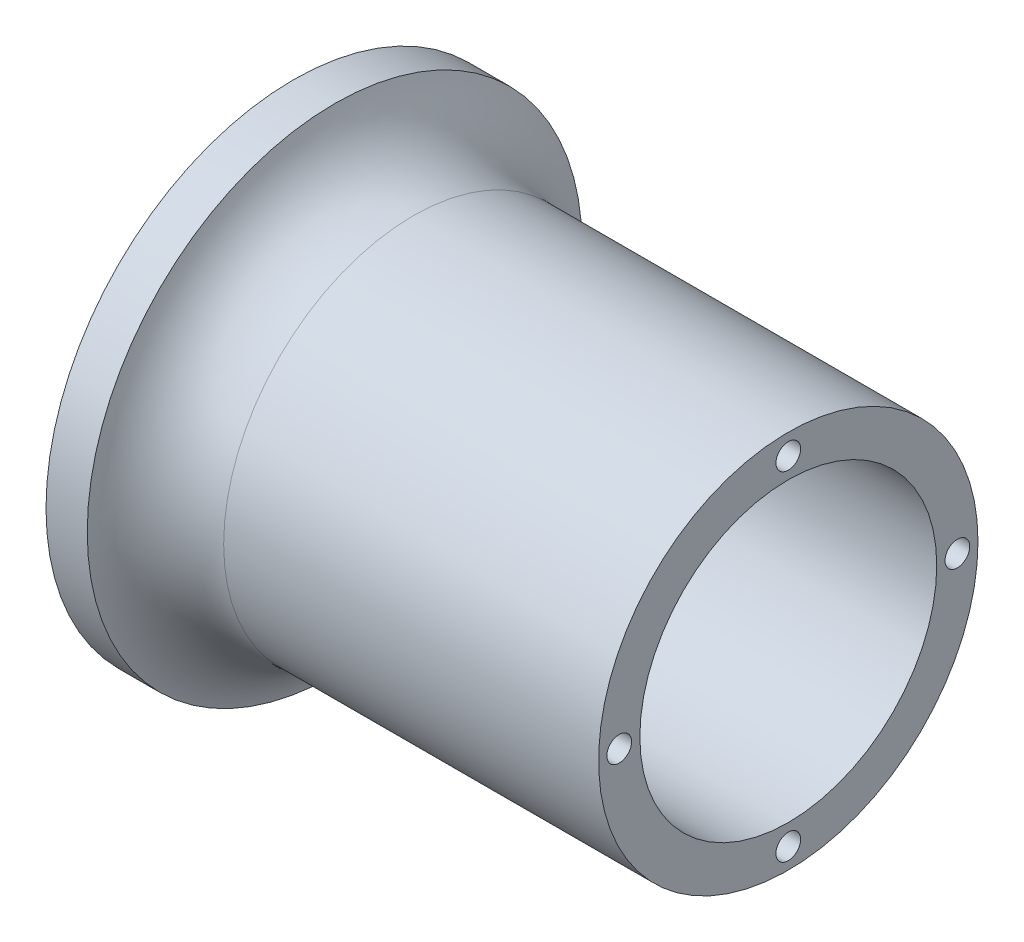
ISO-10303-21;
HEADER;
FILE_DESCRIPTION(('STEP AP214'),'2;1');
FILE_NAME('part.step','',(''),(''),'','','');
FILE_SCHEMA(('AUTOMOTIVE_DESIGN { 1 0 10303 214 1 1 1 1 }'));
ENDSEC;
DATA;
#1=APPLICATION_CONTEXT('core data for automotive mechanical design processes');
#2=APPLICATION_PROTOCOL_DEFINITION('international standard','automotive_design',2000,#1);
#3=PRODUCT_CONTEXT('',#1,'mechanical');
#4=PRODUCT('Part','Part','',(#3));
#5=PRODUCT_RELATED_PRODUCT_CATEGORY('part','',(#4));
#6=PRODUCT_DEFINITION_FORMATION('','',#4);
#7=PRODUCT_DEFINITION_CONTEXT('part definition',#1,'design');
#8=PRODUCT_DEFINITION('design','',#6,#7);
#9=PRODUCT_DEFINITION_SHAPE('','',#8);
#10=(LENGTH_UNIT() NAMED_UNIT(*) SI_UNIT(.MILLI.,.METRE.));
#11=(NAMED_UNIT(*) PLANE_ANGLE_UNIT() SI_UNIT($,.RADIAN.));
#12=(NAMED_UNIT(*) SI_UNIT($,.STERADIAN.) SOLID_ANGLE_UNIT());
#13=UNCERTAINTY_MEASURE_WITH_UNIT(LENGTH_MEASURE(1.E-05),#10,'distance_accuracy_value','');
#14=(GEOMETRIC_REPRESENTATION_CONTEXT(3) GLOBAL_UNCERTAINTY_ASSIGNED_CONTEXT((#13)) GLOBAL_UNIT_ASSIGNED_CONTEXT((#10,
#11,#12)) REPRESENTATION_CONTEXT('',''));
#15=CARTESIAN_POINT('',(0.,0.,0.));
#16=DIRECTION('',(0.,0.,1.));
#17=DIRECTION('',(1.,0.,0.));
#18=AXIS2_PLACEMENT_3D('',#15,#16,#17);
#19=CARTESIAN_POINT('',(-11.,0.,0.));
#20=DIRECTION('',(1.,0.,0.));
#21=DIRECTION('',(0.,0.,-1.));
#22=AXIS2_PLACEMENT_3D('',#19,#20,#21);
#23=CYLINDRICAL_SURFACE('',#22,23.);
#24=CARTESIAN_POINT('',(14.5393920141695,0.,0.));
#25=DIRECTION('',(-1.,0.,0.));
#26=DIRECTION('',(0.,0.,1.));
#27=AXIS2_PLACEMENT_3D('',#24,#25,#26);
#28=CIRCLE('',#27,23.);
#29=CARTESIAN_POINT('',(14.5393920141695,0.,23.));
#30=VERTEX_POINT('',#29);
#31=EDGE_CURVE('E11',#30,#30,#28,.F.);
#32=ORIENTED_EDGE('',*,*,#31,.T.);
#33=EDGE_LOOP('',(#32));
#34=FACE_BOUND('',#33,.T.);
#35=CARTESIAN_POINT('',(60.,0.,0.));
#36=DIRECTION('',(1.,0.,0.));
#37=DIRECTION('',(0.,0.,-1.));
#38=AXIS2_PLACEMENT_3D('',#35,#36,#37);
#39=CIRCLE('',#38,23.);
#40=CARTESIAN_POINT('',(60.,0.,-23.));
#41=VERTEX_POINT('',#40);
#42=EDGE_CURVE('E131',#41,#41,#39,.T.);
#43=ORIENTED_EDGE('',*,*,#42,.F.);
#44=EDGE_LOOP('',(#43));
#45=FACE_BOUND('',#44,.T.);
#46=ADVANCED_FACE('F91',(#34,#45),#23,.T.);
#47=CARTESIAN_POINT('',(3.,0.,-8.5));
#48=DIRECTION('',(-1.,0.,0.));
#49=DIRECTION('',(0.,0.,1.));
#50=AXIS2_PLACEMENT_3D('',#47,#48,#49);
#51=CYLINDRICAL_SURFACE('',#50,3.);
#52=CARTESIAN_POINT('',(0.,0.,-8.5));
#53=DIRECTION('',(1.,0.,0.));
#54=DIRECTION('',(0.,0.,-1.));
#55=AXIS2_PLACEMENT_3D('',#52,#53,#54);
#56=CIRCLE('',#55,3.);
#57=CARTESIAN_POINT('',(0.,0.,-11.5));
#58=VERTEX_POINT('',#57);
#59=EDGE_CURVE('E119',#58,#58,#56,.T.);
#60=ORIENTED_EDGE('',*,*,#59,.F.);
#61=EDGE_LOOP('',(#60));
#62=FACE_BOUND('',#61,.T.);
#63=CARTESIAN_POINT('',(3.,0.,-8.5));
#64=DIRECTION('',(1.,0.,0.));
#65=DIRECTION('',(0.,0.,-1.));
#66=AXIS2_PLACEMENT_3D('',#63,#64,#65);
#67=CIRCLE('',#66,3.);
#68=CARTESIAN_POINT('',(3.,0.,-11.5));
#69=VERTEX_POINT('',#68);
#70=EDGE_CURVE('E188',#69,#69,#67,.T.);
#71=ORIENTED_EDGE('',*,*,#70,.T.);
#72=EDGE_LOOP('',(#71));
#73=FACE_BOUND('',#72,.T.);
#74=ADVANCED_FACE('F239',(#62,#73),#51,.F.);
#75=CARTESIAN_POINT('',(3.,-8.5,0.));
#76=DIRECTION('',(-1.,0.,0.));
#77=DIRECTION('',(0.,0.,1.));
#78=AXIS2_PLACEMENT_3D('',#75,#76,#77);
#79=CYLINDRICAL_SURFACE('',#78,3.);
#80=CARTESIAN_POINT('',(0.,-8.5,0.));
#81=DIRECTION('',(1.,0.,0.));
#82=DIRECTION('',(0.,0.,-1.));
#83=AXIS2_PLACEMENT_3D('',#80,#81,#82);
#84=CIRCLE('',#83,3.);
#85=CARTESIAN_POINT('',(0.,-8.5,-2.99999999999994));
#86=VERTEX_POINT('',#85);
#87=EDGE_CURVE('E109',#86,#86,#84,.T.);
#88=ORIENTED_EDGE('',*,*,#87,.F.);
#89=EDGE_LOOP('',(#88));
#90=FACE_BOUND('',#89,.T.);
#91=CARTESIAN_POINT('',(3.,-8.5,0.));
#92=DIRECTION('',(1.,0.,0.));
#93=DIRECTION('',(0.,0.,-1.));
#94=AXIS2_PLACEMENT_3D('',#91,#92,#93);
#95=CIRCLE('',#94,3.);
#96=CARTESIAN_POINT('',(3.,-8.5,-2.99999999999994));
#97=VERTEX_POINT('',#96);
#98=EDGE_CURVE('E176',#97,#97,#95,.T.);
#99=ORIENTED_EDGE('',*,*,#98,.T.);
#100=EDGE_LOOP('',(#99));
#101=FACE_BOUND('',#100,.T.);
#102=ADVANCED_FACE('F243',(#90,#101),#79,.F.);
#103=CARTESIAN_POINT('',(3.,0.,8.5));
#104=DIRECTION('',(-1.,0.,0.));
#105=DIRECTION('',(0.,0.,1.));
#106=AXIS2_PLACEMENT_3D('',#103,#104,#105);
#107=CYLINDRICAL_SURFACE('',#106,3.);
#108=CARTESIAN_POINT('',(0.,0.,8.5));
#109=DIRECTION('',(1.,0.,0.));
#110=DIRECTION('',(0.,0.,-1.));
#111=AXIS2_PLACEMENT_3D('',#108,#109,#110);
#112=CIRCLE('',#111,3.);
#113=CARTESIAN_POINT('',(0.,0.,5.5));
#114=VERTEX_POINT('',#113);
#115=EDGE_CURVE('E123',#114,#114,#112,.T.);
#116=ORIENTED_EDGE('',*,*,#115,.F.);
#117=EDGE_LOOP('',(#116));
#118=FACE_BOUND('',#117,.T.);
#119=CARTESIAN_POINT('',(3.,0.,8.5));
#120=DIRECTION('',(1.,0.,0.));
#121=DIRECTION('',(0.,0.,-1.));
#122=AXIS2_PLACEMENT_3D('',#119,#120,#121);
#123=CIRCLE('',#122,3.);
#124=CARTESIAN_POINT('',(3.,0.,5.5));
#125=VERTEX_POINT('',#124);
#126=EDGE_CURVE('E164',#125,#125,#123,.T.);
#127=ORIENTED_EDGE('',*,*,#126,.T.);
#128=EDGE_LOOP('',(#127));
#129=FACE_BOUND('',#128,.T.);
#130=ADVANCED_FACE('F248',(#118,#129),#107,.F.);
#131=CARTESIAN_POINT('',(3.,8.5,0.));
#132=DIRECTION('',(-1.,0.,0.));
#133=DIRECTION('',(0.,0.,1.));
#134=AXIS2_PLACEMENT_3D('',#131,#132,#133);
#135=CYLINDRICAL_SURFACE('',#134,3.);
#136=CARTESIAN_POINT('',(0.,8.5,0.));
#137=DIRECTION('',(1.,0.,0.));
#138=DIRECTION('',(0.,0.,-1.));
#139=AXIS2_PLACEMENT_3D('',#136,#137,#138);
#140=CIRCLE('',#139,3.);
#141=CARTESIAN_POINT('',(0.,8.5,-3.));
#142=VERTEX_POINT('',#141);
#143=EDGE_CURVE('E104',#142,#142,#140,.T.);
#144=ORIENTED_EDGE('',*,*,#143,.F.);
#145=EDGE_LOOP('',(#144));
#146=FACE_BOUND('',#145,.T.);
#147=CARTESIAN_POINT('',(3.,8.5,0.));
#148=DIRECTION('',(1.,0.,0.));
#149=DIRECTION('',(0.,0.,-1.));
#150=AXIS2_PLACEMENT_3D('',#147,#148,#149);
#151=CIRCLE('',#150,3.);
#152=CARTESIAN_POINT('',(3.,8.5,-3.));
#153=VERTEX_POINT('',#152);
#154=EDGE_CURVE('E145',#153,#153,#151,.T.);
#155=ORIENTED_EDGE('',*,*,#154,.T.);
#156=EDGE_LOOP('',(#155));
#157=FACE_BOUND('',#156,.T.);
#158=ADVANCED_FACE('F250',(#146,#157),#135,.F.);
#159=CARTESIAN_POINT('',(0.,0.,0.));
#160=DIRECTION('',(1.,0.,0.));
#161=DIRECTION('',(0.,0.,-1.));
#162=AXIS2_PLACEMENT_3D('',#159,#160,#161);
#163=PLANE('',#162);
#164=ORIENTED_EDGE('',*,*,#143,.T.);
#165=EDGE_LOOP('',(#164));
#166=FACE_BOUND('',#165,.T.);
#167=ORIENTED_EDGE('',*,*,#87,.T.);
#168=EDGE_LOOP('',(#167));
#169=FACE_BOUND('',#168,.T.);
#170=CARTESIAN_POINT('',(0.,0.,0.));
#171=DIRECTION('',(1.,0.,0.));
#172=DIRECTION('',(0.,0.,-1.));
#173=AXIS2_PLACEMENT_3D('',#170,#171,#172);
#174=CIRCLE('',#173,5.25);
#175=CARTESIAN_POINT('',(0.,0.,-5.25));
#176=VERTEX_POINT('',#175);
#177=EDGE_CURVE('E115',#176,#176,#174,.T.);
#178=ORIENTED_EDGE('',*,*,#177,.T.);
#179=EDGE_LOOP('',(#178));
#180=FACE_BOUND('',#179,.T.);
#181=ORIENTED_EDGE('',*,*,#59,.T.);
#182=EDGE_LOOP('',(#181));
#183=FACE_BOUND('',#182,.T.);
#184=ORIENTED_EDGE('',*,*,#115,.T.);
#185=EDGE_LOOP('',(#184));
#186=FACE_BOUND('',#185,.T.);
#187=CARTESIAN_POINT('',(0.,0.,0.));
#188=DIRECTION('',(-1.,0.,0.));
#189=DIRECTION('',(0.,0.,1.));
#190=AXIS2_PLACEMENT_3D('',#187,#188,#189);
#191=CIRCLE('',#190,30.);
#192=CARTESIAN_POINT('',(0.,0.,30.));
#193=VERTEX_POINT('',#192);
#194=EDGE_CURVE('E220',#193,#193,#191,.T.);
#195=ORIENTED_EDGE('',*,*,#194,.T.);
#196=EDGE_LOOP('',(#195));
#197=FACE_BOUND('',#196,.T.);
#198=ADVANCED_FACE('F257',(#166,#169,#180,#183,#186,#197),#163,.F.);
#199=CARTESIAN_POINT('',(3.,0.,0.));
#200=DIRECTION('',(-1.,0.,0.));
#201=DIRECTION('',(0.,0.,1.));
#202=AXIS2_PLACEMENT_3D('',#199,#200,#201);
#203=CYLINDRICAL_SURFACE('',#202,5.25);
#204=ORIENTED_EDGE('',*,*,#177,.F.);
#205=EDGE_LOOP('',(#204));
#206=FACE_BOUND('',#205,.T.);
#207=CARTESIAN_POINT('',(6.,0.,0.));
#208=DIRECTION('',(1.,0.,0.));
#209=DIRECTION('',(0.,0.,-1.));
#210=AXIS2_PLACEMENT_3D('',#207,#208,#209);
#211=CIRCLE('',#210,5.25);
#212=CARTESIAN_POINT('',(6.,0.,-5.25));
#213=VERTEX_POINT('',#212);
#214=EDGE_CURVE('E127',#213,#213,#211,.T.);
#215=ORIENTED_EDGE('',*,*,#214,.T.);
#216=EDGE_LOOP('',(#215));
#217=FACE_BOUND('',#216,.T.);
#218=ADVANCED_FACE('F253',(#206,#217),#203,.F.);
#219=CARTESIAN_POINT('',(6.,0.,0.));
#220=DIRECTION('',(1.,0.,0.));
#221=DIRECTION('',(0.,0.,-1.));
#222=AXIS2_PLACEMENT_3D('',#219,#220,#221);
#223=PLANE('',#222);
#224=CARTESIAN_POINT('',(6.,0.,0.));
#225=DIRECTION('',(1.,0.,0.));
#226=DIRECTION('',(0.,0.,-1.));
#227=AXIS2_PLACEMENT_3D('',#224,#225,#226);
#228=CIRCLE('',#227,18.);
#229=CARTESIAN_POINT('',(6.,0.,-18.));
#230=VERTEX_POINT('',#229);
#231=EDGE_CURVE('E99',#230,#230,#228,.F.);
#232=ORIENTED_EDGE('',*,*,#231,.F.);
#233=EDGE_LOOP('',(#232));
#234=FACE_BOUND('',#233,.T.);
#235=ORIENTED_EDGE('',*,*,#214,.F.);
#236=EDGE_LOOP('',(#235));
#237=FACE_BOUND('',#236,.T.);
#238=CARTESIAN_POINT('',(6.,8.5,0.));
#239=DIRECTION('',(1.,0.,0.));
#240=DIRECTION('',(0.,0.,-1.));
#241=AXIS2_PLACEMENT_3D('',#238,#239,#240);
#242=CIRCLE('',#241,1.5);
#243=CARTESIAN_POINT('',(6.,8.5,-1.5));
#244=VERTEX_POINT('',#243);
#245=EDGE_CURVE('E160',#244,#244,#242,.T.);
#246=ORIENTED_EDGE('',*,*,#245,.F.);
#247=EDGE_LOOP('',(#246));
#248=FACE_BOUND('',#247,.T.);
#249=CARTESIAN_POINT('',(6.,0.,8.5));
#250=DIRECTION('',(1.,0.,0.));
#251=DIRECTION('',(0.,0.,-1.));
#252=AXIS2_PLACEMENT_3D('',#249,#250,#251);
#253=CIRCLE('',#252,1.5);
#254=CARTESIAN_POINT('',(6.,0.,7.));
#255=VERTEX_POINT('',#254);
#256=EDGE_CURVE('E172',#255,#255,#253,.T.);
#257=ORIENTED_EDGE('',*,*,#256,.F.);
#258=EDGE_LOOP('',(#257));
#259=FACE_BOUND('',#258,.T.);
#260=CARTESIAN_POINT('',(6.,-8.5,0.));
#261=DIRECTION('',(1.,0.,0.));
#262=DIRECTION('',(0.,0.,-1.));
#263=AXIS2_PLACEMENT_3D('',#260,#261,#262);
#264=CIRCLE('',#263,1.5);
#265=CARTESIAN_POINT('',(6.,-8.5,-1.49999999999994));
#266=VERTEX_POINT('',#265);
#267=EDGE_CURVE('E184',#266,#266,#264,.T.);
#268=ORIENTED_EDGE('',*,*,#267,.F.);
#269=EDGE_LOOP('',(#268));
#270=FACE_BOUND('',#269,.T.);
#271=CARTESIAN_POINT('',(6.,0.,-8.5));
#272=DIRECTION('',(1.,0.,0.));
#273=DIRECTION('',(0.,0.,-1.));
#274=AXIS2_PLACEMENT_3D('',#271,#272,#273);
#275=CIRCLE('',#274,1.5);
#276=CARTESIAN_POINT('',(6.,0.,-10.));
#277=VERTEX_POINT('',#276);
#278=EDGE_CURVE('E196',#277,#277,#275,.T.);
#279=ORIENTED_EDGE('',*,*,#278,.F.);
#280=EDGE_LOOP('',(#279));
#281=FACE_BOUND('',#280,.T.);
#282=ADVANCED_FACE('F256',(#234,#237,#248,#259,#270,#281),#223,.T.);
#283=CARTESIAN_POINT('',(60.,0.,0.));
#284=DIRECTION('',(-1.,0.,0.));
#285=DIRECTION('',(0.,0.,1.));
#286=AXIS2_PLACEMENT_3D('',#283,#284,#285);
#287=CYLINDRICAL_SURFACE('',#286,18.);
#288=ORIENTED_EDGE('',*,*,#231,.T.);
#289=EDGE_LOOP('',(#288));
#290=FACE_BOUND('',#289,.T.);
#291=CARTESIAN_POINT('',(60.,0.,0.));
#292=DIRECTION('',(1.,0.,0.));
#293=DIRECTION('',(0.,0.,-1.));
#294=AXIS2_PLACEMENT_3D('',#291,#292,#293);
#295=CIRCLE('',#294,18.);
#296=CARTESIAN_POINT('',(60.,0.,-18.));
#297=VERTEX_POINT('',#296);
#298=EDGE_CURVE('E135',#297,#297,#295,.T.);
#299=ORIENTED_EDGE('',*,*,#298,.T.);
#300=EDGE_LOOP('',(#299));
#301=FACE_BOUND('',#300,.T.);
#302=ADVANCED_FACE('F270',(#290,#301),#287,.F.);
#303=CARTESIAN_POINT('',(60.,0.,0.));
#304=DIRECTION('',(1.,0.,0.));
#305=DIRECTION('',(0.,0.,-1.));
#306=AXIS2_PLACEMENT_3D('',#303,#304,#305);
#307=PLANE('',#306);
#308=CARTESIAN_POINT('',(60.,20.5,0.));
#309=DIRECTION('',(1.,0.,0.));
#310=DIRECTION('',(0.,0.,-1.));
#311=AXIS2_PLACEMENT_3D('',#308,#309,#310);
#312=CIRCLE('',#311,1.5);
#313=CARTESIAN_POINT('',(60.,20.5,-1.5));
#314=VERTEX_POINT('',#313);
#315=EDGE_CURVE('E139',#314,#314,#312,.T.);
#316=ORIENTED_EDGE('',*,*,#315,.F.);
#317=EDGE_LOOP('',(#316));
#318=FACE_BOUND('',#317,.T.);
#319=CARTESIAN_POINT('',(60.,5.78573092716117E-13,-20.5000000000006));
#320=DIRECTION('',(1.,0.,0.));
#321=DIRECTION('',(0.,0.,-1.));
#322=AXIS2_PLACEMENT_3D('',#319,#320,#321);
#323=CIRCLE('',#322,1.50000000000045);
#324=CARTESIAN_POINT('',(60.,5.78573092716117E-13,-22.000000000001));
#325=VERTEX_POINT('',#324);
#326=EDGE_CURVE('E149',#325,#325,#323,.T.);
#327=ORIENTED_EDGE('',*,*,#326,.F.);
#328=EDGE_LOOP('',(#327));
#329=FACE_BOUND('',#328,.T.);
#330=CARTESIAN_POINT('',(60.,-20.5,-1.15745234713202E-12));
#331=DIRECTION('',(1.,0.,0.));
#332=DIRECTION('',(0.,0.,-1.));
#333=AXIS2_PLACEMENT_3D('',#330,#331,#332);
#334=CIRCLE('',#333,1.50000000000124);
#335=CARTESIAN_POINT('',(60.,-20.5,-1.5000000000024));
#336=VERTEX_POINT('',#335);
#337=EDGE_CURVE('E144',#336,#336,#334,.T.);
#338=ORIENTED_EDGE('',*,*,#337,.F.);
#339=EDGE_LOOP('',(#338));
#340=FACE_BOUND('',#339,.T.);
#341=CARTESIAN_POINT('',(60.,-5.81083618654369E-13,20.4999999999994));
#342=DIRECTION('',(1.,0.,0.));
#343=DIRECTION('',(0.,0.,-1.));
#344=AXIS2_PLACEMENT_3D('',#341,#342,#343);
#345=CIRCLE('',#344,1.50000000000093);
#346=CARTESIAN_POINT('',(60.,-5.81083618654369E-13,18.9999999999985));
#347=VERTEX_POINT('',#346);
#348=EDGE_CURVE('E140',#347,#347,#345,.T.);
#349=ORIENTED_EDGE('',*,*,#348,.F.);
#350=EDGE_LOOP('',(#349));
#351=FACE_BOUND('',#350,.T.);
#352=ORIENTED_EDGE('',*,*,#298,.F.);
#353=EDGE_LOOP('',(#352));
#354=FACE_BOUND('',#353,.T.);
#355=ORIENTED_EDGE('',*,*,#42,.T.);
#356=EDGE_LOOP('',(#355));
#357=FACE_BOUND('',#356,.T.);
#358=ADVANCED_FACE('F274',(#318,#329,#340,#351,#354,#357),#307,.T.);
#359=CARTESIAN_POINT('',(55.,-5.81083618654369E-13,20.4999999999994));
#360=DIRECTION('',(1.,0.,0.));
#361=DIRECTION('',(0.,0.,-1.));
#362=AXIS2_PLACEMENT_3D('',#359,#360,#361);
#363=CYLINDRICAL_SURFACE('',#362,1.50000000000093);
#364=ORIENTED_EDGE('',*,*,#348,.T.);
#365=EDGE_LOOP('',(#364));
#366=FACE_BOUND('',#365,.T.);
#367=CARTESIAN_POINT('',(51.,-5.81083618654369E-13,20.4999999999994));
#368=DIRECTION('',(1.,0.,0.));
#369=DIRECTION('',(0.,0.,-1.));
#370=AXIS2_PLACEMENT_3D('',#367,#368,#369);
#371=CIRCLE('',#370,1.50000000000093);
#372=CARTESIAN_POINT('',(51.,-5.81083618654369E-13,18.9999999999985));
#373=VERTEX_POINT('',#372);
#374=EDGE_CURVE('E204',#373,#373,#371,.T.);
#375=ORIENTED_EDGE('',*,*,#374,.F.);
#376=EDGE_LOOP('',(#375));
#377=FACE_BOUND('',#376,.T.);
#378=ADVANCED_FACE('F277',(#366,#377),#363,.F.);
#379=CARTESIAN_POINT('',(55.,-20.5,-1.15745234713202E-12));
#380=DIRECTION('',(1.,0.,0.));
#381=DIRECTION('',(0.,0.,-1.));
#382=AXIS2_PLACEMENT_3D('',#379,#380,#381);
#383=CYLINDRICAL_SURFACE('',#382,1.50000000000124);
#384=ORIENTED_EDGE('',*,*,#337,.T.);
#385=EDGE_LOOP('',(#384));
#386=FACE_BOUND('',#385,.T.);
#387=CARTESIAN_POINT('',(51.,-20.5,-1.15745234713202E-12));
#388=DIRECTION('',(1.,0.,0.));
#389=DIRECTION('',(0.,0.,-1.));
#390=AXIS2_PLACEMENT_3D('',#387,#388,#389);
#391=CIRCLE('',#390,1.50000000000124);
#392=CARTESIAN_POINT('',(51.,-20.5,-1.5000000000024));
#393=VERTEX_POINT('',#392);
#394=EDGE_CURVE('E208',#393,#393,#391,.T.);
#395=ORIENTED_EDGE('',*,*,#394,.F.);
#396=EDGE_LOOP('',(#395));
#397=FACE_BOUND('',#396,.T.);
#398=ADVANCED_FACE('F281',(#386,#397),#383,.F.);
#399=CARTESIAN_POINT('',(55.,5.78573092716117E-13,-20.5000000000006));
#400=DIRECTION('',(1.,0.,0.));
#401=DIRECTION('',(0.,0.,-1.));
#402=AXIS2_PLACEMENT_3D('',#399,#400,#401);
#403=CYLINDRICAL_SURFACE('',#402,1.50000000000045);
#404=ORIENTED_EDGE('',*,*,#326,.T.);
#405=EDGE_LOOP('',(#404));
#406=FACE_BOUND('',#405,.T.);
#407=CARTESIAN_POINT('',(51.,5.78573092716117E-13,-20.5000000000006));
#408=DIRECTION('',(1.,0.,0.));
#409=DIRECTION('',(0.,0.,-1.));
#410=AXIS2_PLACEMENT_3D('',#407,#408,#409);
#411=CIRCLE('',#410,1.50000000000045);
#412=CARTESIAN_POINT('',(51.,5.78573092716117E-13,-22.000000000001));
#413=VERTEX_POINT('',#412);
#414=EDGE_CURVE('E213',#413,#413,#411,.T.);
#415=ORIENTED_EDGE('',*,*,#414,.F.);
#416=EDGE_LOOP('',(#415));
#417=FACE_BOUND('',#416,.T.);
#418=ADVANCED_FACE('F285',(#406,#417),#403,.F.);
#419=CARTESIAN_POINT('',(55.,20.5,0.));
#420=DIRECTION('',(1.,0.,0.));
#421=DIRECTION('',(0.,0.,-1.));
#422=AXIS2_PLACEMENT_3D('',#419,#420,#421);
#423=CYLINDRICAL_SURFACE('',#422,1.5);
#424=ORIENTED_EDGE('',*,*,#315,.T.);
#425=EDGE_LOOP('',(#424));
#426=FACE_BOUND('',#425,.T.);
#427=CARTESIAN_POINT('',(51.,20.5,0.));
#428=DIRECTION('',(1.,0.,0.));
#429=DIRECTION('',(0.,0.,-1.));
#430=AXIS2_PLACEMENT_3D('',#427,#428,#429);
#431=CIRCLE('',#430,1.5);
#432=CARTESIAN_POINT('',(51.,20.5,-1.5));
#433=VERTEX_POINT('',#432);
#434=EDGE_CURVE('E200',#433,#433,#431,.T.);
#435=ORIENTED_EDGE('',*,*,#434,.F.);
#436=EDGE_LOOP('',(#435));
#437=FACE_BOUND('',#436,.T.);
#438=ADVANCED_FACE('F289',(#426,#437),#423,.F.);
#439=CARTESIAN_POINT('',(3.,8.5,0.));
#440=DIRECTION('',(1.,0.,0.));
#441=DIRECTION('',(0.,0.,-1.));
#442=AXIS2_PLACEMENT_3D('',#439,#440,#441);
#443=PLANE('',#442);
#444=CARTESIAN_POINT('',(3.,8.5,0.));
#445=DIRECTION('',(1.,0.,0.));
#446=DIRECTION('',(0.,0.,-1.));
#447=AXIS2_PLACEMENT_3D('',#444,#445,#446);
#448=CIRCLE('',#447,1.5);
#449=CARTESIAN_POINT('',(3.,8.5,-1.5));
#450=VERTEX_POINT('',#449);
#451=EDGE_CURVE('E159',#450,#450,#448,.T.);
#452=ORIENTED_EDGE('',*,*,#451,.T.);
#453=EDGE_LOOP('',(#452));
#454=FACE_BOUND('',#453,.T.);
#455=ORIENTED_EDGE('',*,*,#154,.F.);
#456=EDGE_LOOP('',(#455));
#457=FACE_BOUND('',#456,.T.);
#458=ADVANCED_FACE('F293',(#454,#457),#443,.F.);
#459=CARTESIAN_POINT('',(3.,8.5,0.));
#460=DIRECTION('',(1.,0.,0.));
#461=DIRECTION('',(0.,0.,-1.));
#462=AXIS2_PLACEMENT_3D('',#459,#460,#461);
#463=CYLINDRICAL_SURFACE('',#462,1.5);
#464=ORIENTED_EDGE('',*,*,#451,.F.);
#465=EDGE_LOOP('',(#464));
#466=FACE_BOUND('',#465,.T.);
#467=ORIENTED_EDGE('',*,*,#245,.T.);
#468=EDGE_LOOP('',(#467));
#469=FACE_BOUND('',#468,.T.);
#470=ADVANCED_FACE('F297',(#466,#469),#463,.F.);
#471=CARTESIAN_POINT('',(3.,0.,8.5));
#472=DIRECTION('',(1.,0.,0.));
#473=DIRECTION('',(0.,0.,-1.));
#474=AXIS2_PLACEMENT_3D('',#471,#472,#473);
#475=PLANE('',#474);
#476=CARTESIAN_POINT('',(3.,0.,8.5));
#477=DIRECTION('',(1.,0.,0.));
#478=DIRECTION('',(0.,0.,-1.));
#479=AXIS2_PLACEMENT_3D('',#476,#477,#478);
#480=CIRCLE('',#479,1.5);
#481=CARTESIAN_POINT('',(3.,0.,7.));
#482=VERTEX_POINT('',#481);
#483=EDGE_CURVE('E171',#482,#482,#480,.T.);
#484=ORIENTED_EDGE('',*,*,#483,.T.);
#485=EDGE_LOOP('',(#484));
#486=FACE_BOUND('',#485,.T.);
#487=ORIENTED_EDGE('',*,*,#126,.F.);
#488=EDGE_LOOP('',(#487));
#489=FACE_BOUND('',#488,.T.);
#490=ADVANCED_FACE('F301',(#486,#489),#475,.F.);
#491=CARTESIAN_POINT('',(3.,0.,8.5));
#492=DIRECTION('',(1.,0.,0.));
#493=DIRECTION('',(0.,0.,-1.));
#494=AXIS2_PLACEMENT_3D('',#491,#492,#493);
#495=CYLINDRICAL_SURFACE('',#494,1.5);
#496=ORIENTED_EDGE('',*,*,#483,.F.);
#497=EDGE_LOOP('',(#496));
#498=FACE_BOUND('',#497,.T.);
#499=ORIENTED_EDGE('',*,*,#256,.T.);
#500=EDGE_LOOP('',(#499));
#501=FACE_BOUND('',#500,.T.);
#502=ADVANCED_FACE('F305',(#498,#501),#495,.F.);
#503=CARTESIAN_POINT('',(3.,-8.5,0.));
#504=DIRECTION('',(1.,0.,0.));
#505=DIRECTION('',(0.,0.,-1.));
#506=AXIS2_PLACEMENT_3D('',#503,#504,#505);
#507=PLANE('',#506);
#508=CARTESIAN_POINT('',(3.,-8.5,0.));
#509=DIRECTION('',(1.,0.,0.));
#510=DIRECTION('',(0.,0.,-1.));
#511=AXIS2_PLACEMENT_3D('',#508,#509,#510);
#512=CIRCLE('',#511,1.5);
#513=CARTESIAN_POINT('',(3.,-8.5,-1.49999999999994));
#514=VERTEX_POINT('',#513);
#515=EDGE_CURVE('E183',#514,#514,#512,.T.);
#516=ORIENTED_EDGE('',*,*,#515,.T.);
#517=EDGE_LOOP('',(#516));
#518=FACE_BOUND('',#517,.T.);
#519=ORIENTED_EDGE('',*,*,#98,.F.);
#520=EDGE_LOOP('',(#519));
#521=FACE_BOUND('',#520,.T.);
#522=ADVANCED_FACE('F309',(#518,#521),#507,.F.);
#523=CARTESIAN_POINT('',(3.,-8.5,0.));
#524=DIRECTION('',(1.,0.,0.));
#525=DIRECTION('',(0.,0.,-1.));
#526=AXIS2_PLACEMENT_3D('',#523,#524,#525);
#527=CYLINDRICAL_SURFACE('',#526,1.5);
#528=ORIENTED_EDGE('',*,*,#515,.F.);
#529=EDGE_LOOP('',(#528));
#530=FACE_BOUND('',#529,.T.);
#531=ORIENTED_EDGE('',*,*,#267,.T.);
#532=EDGE_LOOP('',(#531));
#533=FACE_BOUND('',#532,.T.);
#534=ADVANCED_FACE('F313',(#530,#533),#527,.F.);
#535=CARTESIAN_POINT('',(3.,0.,-8.5));
#536=DIRECTION('',(1.,0.,0.));
#537=DIRECTION('',(0.,0.,-1.));
#538=AXIS2_PLACEMENT_3D('',#535,#536,#537);
#539=PLANE('',#538);
#540=CARTESIAN_POINT('',(3.,0.,-8.5));
#541=DIRECTION('',(1.,0.,0.));
#542=DIRECTION('',(0.,0.,-1.));
#543=AXIS2_PLACEMENT_3D('',#540,#541,#542);
#544=CIRCLE('',#543,1.5);
#545=CARTESIAN_POINT('',(3.,0.,-10.));
#546=VERTEX_POINT('',#545);
#547=EDGE_CURVE('E195',#546,#546,#544,.T.);
#548=ORIENTED_EDGE('',*,*,#547,.T.);
#549=EDGE_LOOP('',(#548));
#550=FACE_BOUND('',#549,.T.);
#551=ORIENTED_EDGE('',*,*,#70,.F.);
#552=EDGE_LOOP('',(#551));
#553=FACE_BOUND('',#552,.T.);
#554=ADVANCED_FACE('F317',(#550,#553),#539,.F.);
#555=CARTESIAN_POINT('',(3.,0.,-8.5));
#556=DIRECTION('',(1.,0.,0.));
#557=DIRECTION('',(0.,0.,-1.));
#558=AXIS2_PLACEMENT_3D('',#555,#556,#557);
#559=CYLINDRICAL_SURFACE('',#558,1.5);
#560=ORIENTED_EDGE('',*,*,#547,.F.);
#561=EDGE_LOOP('',(#560));
#562=FACE_BOUND('',#561,.T.);
#563=ORIENTED_EDGE('',*,*,#278,.T.);
#564=EDGE_LOOP('',(#563));
#565=FACE_BOUND('',#564,.T.);
#566=ADVANCED_FACE('F321',(#562,#565),#559,.F.);
#567=CARTESIAN_POINT('',(51.,20.5,0.));
#568=DIRECTION('',(1.,0.,0.));
#569=DIRECTION('',(0.,0.,-1.));
#570=AXIS2_PLACEMENT_3D('',#567,#568,#569);
#571=PLANE('',#570);
#572=ORIENTED_EDGE('',*,*,#434,.T.);
#573=EDGE_LOOP('',(#572));
#574=FACE_BOUND('',#573,.T.);
#575=ADVANCED_FACE('F325',(#574),#571,.T.);
#576=CARTESIAN_POINT('',(51.,5.78573092716117E-13,-20.5000000000006));
#577=DIRECTION('',(1.,0.,0.));
#578=DIRECTION('',(0.,0.,-1.));
#579=AXIS2_PLACEMENT_3D('',#576,#577,#578);
#580=PLANE('',#579);
#581=ORIENTED_EDGE('',*,*,#414,.T.);
#582=EDGE_LOOP('',(#581));
#583=FACE_BOUND('',#582,.T.);
#584=ADVANCED_FACE('F333',(#583),#580,.T.);
#585=CARTESIAN_POINT('',(51.,-20.5,-1.15745234713202E-12));
#586=DIRECTION('',(1.,0.,0.));
#587=DIRECTION('',(0.,0.,-1.));
#588=AXIS2_PLACEMENT_3D('',#585,#586,#587);
#589=PLANE('',#588);
#590=ORIENTED_EDGE('',*,*,#394,.T.);
#591=EDGE_LOOP('',(#590));
#592=FACE_BOUND('',#591,.T.);
#593=ADVANCED_FACE('F329',(#592),#589,.T.);
#594=CARTESIAN_POINT('',(51.,-5.81083618654369E-13,20.4999999999994));
#595=DIRECTION('',(1.,0.,0.));
#596=DIRECTION('',(0.,0.,-1.));
#597=AXIS2_PLACEMENT_3D('',#594,#595,#596);
#598=PLANE('',#597);
#599=ORIENTED_EDGE('',*,*,#374,.T.);
#600=EDGE_LOOP('',(#599));
#601=FACE_BOUND('',#600,.T.);
#602=ADVANCED_FACE('F236',(#601),#598,.T.);
#603=CARTESIAN_POINT('',(5.,0.,0.));
#604=DIRECTION('',(-1.,0.,0.));
#605=DIRECTION('',(0.,0.,1.));
#606=AXIS2_PLACEMENT_3D('',#603,#604,#605);
#607=CYLINDRICAL_SURFACE('',#606,30.);
#608=CARTESIAN_POINT('',(5.,0.,0.));
#609=DIRECTION('',(-1.,0.,0.));
#610=DIRECTION('',(0.,0.,1.));
#611=AXIS2_PLACEMENT_3D('',#608,#609,#610);
#612=CIRCLE('',#611,30.);
#613=CARTESIAN_POINT('',(5.,0.,30.));
#614=VERTEX_POINT('',#613);
#615=EDGE_CURVE('E209',#614,#614,#612,.T.);
#616=ORIENTED_EDGE('',*,*,#615,.T.);
#617=EDGE_LOOP('',(#616));
#618=FACE_BOUND('',#617,.T.);
#619=ORIENTED_EDGE('',*,*,#194,.F.);
#620=EDGE_LOOP('',(#619));
#621=FACE_BOUND('',#620,.T.);
#622=ADVANCED_FACE('F228',(#618,#621),#607,.T.);
#623=CARTESIAN_POINT('',(14.5393920141695,0.,0.));
#624=DIRECTION('',(-1.,0.,0.));
#625=DIRECTION('',(0.,0.,1.));
#626=AXIS2_PLACEMENT_3D('',#623,#624,#625);
#627=TOROIDAL_SURFACE('',#626,33.,10.);
#628=ORIENTED_EDGE('',*,*,#31,.F.);
#629=EDGE_LOOP('',(#628));
#630=FACE_BOUND('',#629,.T.);
#631=ORIENTED_EDGE('',*,*,#615,.F.);
#632=EDGE_LOOP('',(#631));
#633=FACE_BOUND('',#632,.T.);
#634=ADVANCED_FACE('F93',(#630,#633),#627,.F.);
#635=CLOSED_SHELL('',(#46,#74,#102,#130,#158,#198,#218,#282,#302,#358,#378,#398,#418,#438,#458,
#470,#490,#502,#522,#534,#554,#566,#575,#584,#593,#602,#622,#634));
#636=MANIFOLD_SOLID_BREP('B2',#635);
#637=ADVANCED_BREP_SHAPE_REPRESENTATION('',(#18,#636),#14);
#638=SHAPE_DEFINITION_REPRESENTATION(#9,#637);
ENDSEC;
END-ISO-10303-21;
